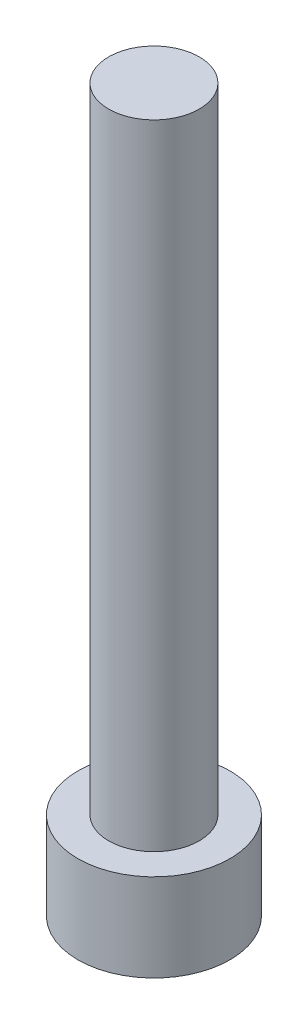
ISO-10303-21;
HEADER;
FILE_DESCRIPTION(('STEP AP214'),'2;1');
FILE_NAME('part.step','',(''),(''),'','','');
FILE_SCHEMA(('AUTOMOTIVE_DESIGN { 1 0 10303 214 1 1 1 1 }'));
ENDSEC;
DATA;
#1=APPLICATION_CONTEXT('core data for automotive mechanical design processes');
#2=APPLICATION_PROTOCOL_DEFINITION('international standard','automotive_design',2000,#1);
#3=PRODUCT_CONTEXT('',#1,'mechanical');
#4=PRODUCT('Part','Part','',(#3));
#5=PRODUCT_RELATED_PRODUCT_CATEGORY('part','',(#4));
#6=PRODUCT_DEFINITION_FORMATION('','',#4);
#7=PRODUCT_DEFINITION_CONTEXT('part definition',#1,'design');
#8=PRODUCT_DEFINITION('design','',#6,#7);
#9=PRODUCT_DEFINITION_SHAPE('','',#8);
#10=(LENGTH_UNIT() NAMED_UNIT(*) SI_UNIT(.MILLI.,.METRE.));
#11=(NAMED_UNIT(*) PLANE_ANGLE_UNIT() SI_UNIT($,.RADIAN.));
#12=(NAMED_UNIT(*) SI_UNIT($,.STERADIAN.) SOLID_ANGLE_UNIT());
#13=UNCERTAINTY_MEASURE_WITH_UNIT(LENGTH_MEASURE(1.E-05),#10,'distance_accuracy_value','');
#14=(GEOMETRIC_REPRESENTATION_CONTEXT(3) GLOBAL_UNCERTAINTY_ASSIGNED_CONTEXT((#13)) GLOBAL_UNIT_ASSIGNED_CONTEXT((#10,
#11,#12)) REPRESENTATION_CONTEXT('',''));
#15=CARTESIAN_POINT('',(0.,0.,0.));
#16=DIRECTION('',(0.,0.,1.));
#17=DIRECTION('',(1.,0.,0.));
#18=AXIS2_PLACEMENT_3D('',#15,#16,#17);
#19=CARTESIAN_POINT('',(0.,4.84,0.));
#20=DIRECTION('',(0.,-1.,0.));
#21=DIRECTION('',(0.,0.,-1.));
#22=AXIS2_PLACEMENT_3D('',#19,#20,#21);
#23=CYLINDRICAL_SURFACE('',#22,4.2);
#24=CARTESIAN_POINT('',(0.,4.84,0.));
#25=DIRECTION('',(0.,1.,0.));
#26=DIRECTION('',(0.,0.,1.));
#27=AXIS2_PLACEMENT_3D('',#24,#25,#26);
#28=CIRCLE('',#27,4.2);
#29=CARTESIAN_POINT('',(0.,4.84,4.2));
#30=VERTEX_POINT('',#29);
#31=EDGE_CURVE('E43',#30,#30,#28,.T.);
#32=ORIENTED_EDGE('',*,*,#31,.F.);
#33=EDGE_LOOP('',(#32));
#34=FACE_BOUND('',#33,.T.);
#35=CARTESIAN_POINT('',(0.,0.,0.));
#36=DIRECTION('',(0.,1.,0.));
#37=DIRECTION('',(0.,0.,1.));
#38=AXIS2_PLACEMENT_3D('',#35,#36,#37);
#39=CIRCLE('',#38,4.2);
#40=CARTESIAN_POINT('',(0.,0.,4.2));
#41=VERTEX_POINT('',#40);
#42=EDGE_CURVE('E38',#41,#41,#39,.T.);
#43=ORIENTED_EDGE('',*,*,#42,.T.);
#44=EDGE_LOOP('',(#43));
#45=FACE_BOUND('',#44,.T.);
#46=ADVANCED_FACE('F35',(#34,#45),#23,.T.);
#47=CARTESIAN_POINT('',(0.,4.84,0.));
#48=DIRECTION('',(0.,1.,0.));
#49=DIRECTION('',(0.,0.,1.));
#50=AXIS2_PLACEMENT_3D('',#47,#48,#49);
#51=PLANE('',#50);
#52=CARTESIAN_POINT('',(0.,4.84,0.));
#53=DIRECTION('',(0.,1.,0.));
#54=DIRECTION('',(0.,0.,1.));
#55=AXIS2_PLACEMENT_3D('',#52,#53,#54);
#56=CIRCLE('',#55,2.5);
#57=CARTESIAN_POINT('',(0.,4.84,2.5));
#58=VERTEX_POINT('',#57);
#59=EDGE_CURVE('E11',#58,#58,#56,.T.);
#60=ORIENTED_EDGE('',*,*,#59,.F.);
#61=EDGE_LOOP('',(#60));
#62=FACE_BOUND('',#61,.T.);
#63=ORIENTED_EDGE('',*,*,#31,.T.);
#64=EDGE_LOOP('',(#63));
#65=FACE_BOUND('',#64,.T.);
#66=ADVANCED_FACE('F155',(#62,#65),#51,.T.);
#67=CARTESIAN_POINT('',(0.,0.,0.));
#68=DIRECTION('',(0.,1.,0.));
#69=DIRECTION('',(0.,0.,1.));
#70=AXIS2_PLACEMENT_3D('',#67,#68,#69);
#71=PLANE('',#70);
#72=DIRECTION('',(-0.5,0.,0.866025403784439));
#73=VECTOR('',#72,1.);
#74=CARTESIAN_POINT('',(2.3,0.,0.));
#75=LINE('',#74,#73);
#76=CARTESIAN_POINT('',(2.3,0.,0.));
#77=VERTEX_POINT('',#76);
#78=CARTESIAN_POINT('',(1.15,0.,1.99185842870421));
#79=VERTEX_POINT('',#78);
#80=EDGE_CURVE('E125',#77,#79,#75,.T.);
#81=ORIENTED_EDGE('',*,*,#80,.F.);
#82=DIRECTION('',(0.5,0.,0.866025403784439));
#83=VECTOR('',#82,1.);
#84=CARTESIAN_POINT('',(1.15,0.,-1.99185842870421));
#85=LINE('',#84,#83);
#86=CARTESIAN_POINT('',(1.15,0.,-1.99185842870421));
#87=VERTEX_POINT('',#86);
#88=EDGE_CURVE('E51',#87,#77,#85,.T.);
#89=ORIENTED_EDGE('',*,*,#88,.F.);
#90=DIRECTION('',(1.,0.,0.));
#91=VECTOR('',#90,1.);
#92=CARTESIAN_POINT('',(-1.15,0.,-1.99185842870421));
#93=LINE('',#92,#91);
#94=CARTESIAN_POINT('',(-1.15,0.,-1.99185842870421));
#95=VERTEX_POINT('',#94);
#96=EDGE_CURVE('E134',#95,#87,#93,.T.);
#97=ORIENTED_EDGE('',*,*,#96,.F.);
#98=DIRECTION('',(0.5,0.,-0.866025403784439));
#99=VECTOR('',#98,1.);
#100=CARTESIAN_POINT('',(-2.3,0.,0.));
#101=LINE('',#100,#99);
#102=CARTESIAN_POINT('',(-2.3,0.,0.));
#103=VERTEX_POINT('',#102);
#104=EDGE_CURVE('E132',#103,#95,#101,.T.);
#105=ORIENTED_EDGE('',*,*,#104,.F.);
#106=DIRECTION('',(-0.5,0.,-0.866025403784439));
#107=VECTOR('',#106,1.);
#108=CARTESIAN_POINT('',(-1.15,0.,1.99185842870421));
#109=LINE('',#108,#107);
#110=CARTESIAN_POINT('',(-1.15,0.,1.99185842870421));
#111=VERTEX_POINT('',#110);
#112=EDGE_CURVE('E99',#111,#103,#109,.T.);
#113=ORIENTED_EDGE('',*,*,#112,.F.);
#114=DIRECTION('',(-1.,0.,0.));
#115=VECTOR('',#114,1.);
#116=CARTESIAN_POINT('',(1.15,0.,1.99185842870421));
#117=LINE('',#116,#115);
#118=EDGE_CURVE('E128',#79,#111,#117,.T.);
#119=ORIENTED_EDGE('',*,*,#118,.F.);
#120=EDGE_LOOP('',(#81,#89,#97,#105,#113,#119));
#121=FACE_BOUND('',#120,.T.);
#122=ORIENTED_EDGE('',*,*,#42,.F.);
#123=EDGE_LOOP('',(#122));
#124=FACE_BOUND('',#123,.T.);
#125=ADVANCED_FACE('F152',(#121,#124),#71,.F.);
#126=CARTESIAN_POINT('',(0.,39.84,0.));
#127=DIRECTION('',(0.,-1.,0.));
#128=DIRECTION('',(0.,0.,-1.));
#129=AXIS2_PLACEMENT_3D('',#126,#127,#128);
#130=CYLINDRICAL_SURFACE('',#129,2.5);
#131=CARTESIAN_POINT('',(0.,39.84,0.));
#132=DIRECTION('',(0.,1.,0.));
#133=DIRECTION('',(0.,0.,1.));
#134=AXIS2_PLACEMENT_3D('',#131,#132,#133);
#135=CIRCLE('',#134,2.5);
#136=CARTESIAN_POINT('',(0.,39.84,2.5));
#137=VERTEX_POINT('',#136);
#138=EDGE_CURVE('E138',#137,#137,#135,.T.);
#139=ORIENTED_EDGE('',*,*,#138,.F.);
#140=EDGE_LOOP('',(#139));
#141=FACE_BOUND('',#140,.T.);
#142=ORIENTED_EDGE('',*,*,#59,.T.);
#143=EDGE_LOOP('',(#142));
#144=FACE_BOUND('',#143,.T.);
#145=ADVANCED_FACE('F154',(#141,#144),#130,.T.);
#146=CARTESIAN_POINT('',(0.,39.84,0.));
#147=DIRECTION('',(0.,1.,0.));
#148=DIRECTION('',(0.,0.,1.));
#149=AXIS2_PLACEMENT_3D('',#146,#147,#148);
#150=PLANE('',#149);
#151=ORIENTED_EDGE('',*,*,#138,.T.);
#152=EDGE_LOOP('',(#151));
#153=FACE_BOUND('',#152,.T.);
#154=ADVANCED_FACE('F161',(#153),#150,.T.);
#155=CARTESIAN_POINT('',(1.15,3.4,-1.99185842870421));
#156=DIRECTION('',(0.866025403784439,0.,-0.5));
#157=DIRECTION('',(-0.5,0.,-0.866025403784439));
#158=AXIS2_PLACEMENT_3D('',#155,#156,#157);
#159=PLANE('',#158);
#160=ORIENTED_EDGE('',*,*,#88,.T.);
#161=DIRECTION('',(0.,-1.,0.));
#162=VECTOR('',#161,1.);
#163=CARTESIAN_POINT('',(2.3,3.4,0.));
#164=LINE('',#163,#162);
#165=CARTESIAN_POINT('',(2.3,3.4,0.));
#166=VERTEX_POINT('',#165);
#167=EDGE_CURVE('E81',#166,#77,#164,.T.);
#168=ORIENTED_EDGE('',*,*,#167,.F.);
#169=DIRECTION('',(0.5,0.,0.866025403784439));
#170=VECTOR('',#169,1.);
#171=CARTESIAN_POINT('',(1.15,3.4,-1.99185842870421));
#172=LINE('',#171,#170);
#173=CARTESIAN_POINT('',(1.15,3.4,-1.99185842870421));
#174=VERTEX_POINT('',#173);
#175=EDGE_CURVE('E136',#174,#166,#172,.T.);
#176=ORIENTED_EDGE('',*,*,#175,.F.);
#177=DIRECTION('',(0.,-1.,0.));
#178=VECTOR('',#177,1.);
#179=CARTESIAN_POINT('',(1.15,3.4,-1.99185842870421));
#180=LINE('',#179,#178);
#181=EDGE_CURVE('E59',#174,#87,#180,.T.);
#182=ORIENTED_EDGE('',*,*,#181,.T.);
#183=EDGE_LOOP('',(#160,#168,#176,#182));
#184=FACE_BOUND('',#183,.T.);
#185=ADVANCED_FACE('F190',(#184),#159,.F.);
#186=CARTESIAN_POINT('',(-1.15,3.4,-1.99185842870421));
#187=DIRECTION('',(0.,0.,-1.));
#188=DIRECTION('',(-1.,0.,0.));
#189=AXIS2_PLACEMENT_3D('',#186,#187,#188);
#190=PLANE('',#189);
#191=ORIENTED_EDGE('',*,*,#96,.T.);
#192=ORIENTED_EDGE('',*,*,#181,.F.);
#193=DIRECTION('',(1.,0.,0.));
#194=VECTOR('',#193,1.);
#195=CARTESIAN_POINT('',(-1.15,3.4,-1.99185842870421));
#196=LINE('',#195,#194);
#197=CARTESIAN_POINT('',(-1.15,3.4,-1.99185842870421));
#198=VERTEX_POINT('',#197);
#199=EDGE_CURVE('E111',#198,#174,#196,.T.);
#200=ORIENTED_EDGE('',*,*,#199,.F.);
#201=DIRECTION('',(0.,-1.,0.));
#202=VECTOR('',#201,1.);
#203=CARTESIAN_POINT('',(-1.15,3.4,-1.99185842870421));
#204=LINE('',#203,#202);
#205=EDGE_CURVE('E103',#198,#95,#204,.T.);
#206=ORIENTED_EDGE('',*,*,#205,.T.);
#207=EDGE_LOOP('',(#191,#192,#200,#206));
#208=FACE_BOUND('',#207,.T.);
#209=ADVANCED_FACE('F204',(#208),#190,.F.);
#210=CARTESIAN_POINT('',(-2.3,3.4,0.));
#211=DIRECTION('',(-0.866025403784439,0.,-0.5));
#212=DIRECTION('',(-0.5,0.,0.866025403784439));
#213=AXIS2_PLACEMENT_3D('',#210,#211,#212);
#214=PLANE('',#213);
#215=ORIENTED_EDGE('',*,*,#104,.T.);
#216=ORIENTED_EDGE('',*,*,#205,.F.);
#217=DIRECTION('',(0.5,0.,-0.866025403784439));
#218=VECTOR('',#217,1.);
#219=CARTESIAN_POINT('',(-2.3,3.4,0.));
#220=LINE('',#219,#218);
#221=CARTESIAN_POINT('',(-2.3,3.4,0.));
#222=VERTEX_POINT('',#221);
#223=EDGE_CURVE('E107',#222,#198,#220,.T.);
#224=ORIENTED_EDGE('',*,*,#223,.F.);
#225=DIRECTION('',(0.,-1.,0.));
#226=VECTOR('',#225,1.);
#227=CARTESIAN_POINT('',(-2.3,3.4,0.));
#228=LINE('',#227,#226);
#229=EDGE_CURVE('E92',#222,#103,#228,.T.);
#230=ORIENTED_EDGE('',*,*,#229,.T.);
#231=EDGE_LOOP('',(#215,#216,#224,#230));
#232=FACE_BOUND('',#231,.T.);
#233=ADVANCED_FACE('F108',(#232),#214,.F.);
#234=CARTESIAN_POINT('',(-1.15,3.4,1.99185842870421));
#235=DIRECTION('',(-0.866025403784439,0.,0.5));
#236=DIRECTION('',(0.5,0.,0.866025403784439));
#237=AXIS2_PLACEMENT_3D('',#234,#235,#236);
#238=PLANE('',#237);
#239=ORIENTED_EDGE('',*,*,#112,.T.);
#240=ORIENTED_EDGE('',*,*,#229,.F.);
#241=DIRECTION('',(-0.5,0.,-0.866025403784439));
#242=VECTOR('',#241,1.);
#243=CARTESIAN_POINT('',(-1.15,3.4,1.99185842870421));
#244=LINE('',#243,#242);
#245=CARTESIAN_POINT('',(-1.15,3.4,1.99185842870421));
#246=VERTEX_POINT('',#245);
#247=EDGE_CURVE('E96',#246,#222,#244,.T.);
#248=ORIENTED_EDGE('',*,*,#247,.F.);
#249=DIRECTION('',(0.,-1.,0.));
#250=VECTOR('',#249,1.);
#251=CARTESIAN_POINT('',(-1.15,3.4,1.99185842870421));
#252=LINE('',#251,#250);
#253=EDGE_CURVE('E104',#246,#111,#252,.T.);
#254=ORIENTED_EDGE('',*,*,#253,.T.);
#255=EDGE_LOOP('',(#239,#240,#248,#254));
#256=FACE_BOUND('',#255,.T.);
#257=ADVANCED_FACE('F94',(#256),#238,.F.);
#258=CARTESIAN_POINT('',(1.15,3.4,1.99185842870421));
#259=DIRECTION('',(0.,0.,1.));
#260=DIRECTION('',(1.,0.,0.));
#261=AXIS2_PLACEMENT_3D('',#258,#259,#260);
#262=PLANE('',#261);
#263=ORIENTED_EDGE('',*,*,#118,.T.);
#264=ORIENTED_EDGE('',*,*,#253,.F.);
#265=DIRECTION('',(-1.,0.,0.));
#266=VECTOR('',#265,1.);
#267=CARTESIAN_POINT('',(1.15,3.4,1.99185842870421));
#268=LINE('',#267,#266);
#269=CARTESIAN_POINT('',(1.15,3.4,1.99185842870421));
#270=VERTEX_POINT('',#269);
#271=EDGE_CURVE('E117',#270,#246,#268,.T.);
#272=ORIENTED_EDGE('',*,*,#271,.F.);
#273=DIRECTION('',(0.,-1.,0.));
#274=VECTOR('',#273,1.);
#275=CARTESIAN_POINT('',(1.15,3.4,1.99185842870421));
#276=LINE('',#275,#274);
#277=EDGE_CURVE('E141',#270,#79,#276,.T.);
#278=ORIENTED_EDGE('',*,*,#277,.T.);
#279=EDGE_LOOP('',(#263,#264,#272,#278));
#280=FACE_BOUND('',#279,.T.);
#281=ADVANCED_FACE('F229',(#280),#262,.F.);
#282=CARTESIAN_POINT('',(2.3,3.4,0.));
#283=DIRECTION('',(0.866025403784439,0.,0.5));
#284=DIRECTION('',(0.5,0.,-0.866025403784439));
#285=AXIS2_PLACEMENT_3D('',#282,#283,#284);
#286=PLANE('',#285);
#287=ORIENTED_EDGE('',*,*,#80,.T.);
#288=ORIENTED_EDGE('',*,*,#277,.F.);
#289=DIRECTION('',(-0.5,0.,0.866025403784439));
#290=VECTOR('',#289,1.);
#291=CARTESIAN_POINT('',(2.3,3.4,0.));
#292=LINE('',#291,#290);
#293=EDGE_CURVE('E119',#166,#270,#292,.T.);
#294=ORIENTED_EDGE('',*,*,#293,.F.);
#295=ORIENTED_EDGE('',*,*,#167,.T.);
#296=EDGE_LOOP('',(#287,#288,#294,#295));
#297=FACE_BOUND('',#296,.T.);
#298=ADVANCED_FACE('F238',(#297),#286,.F.);
#299=CARTESIAN_POINT('',(0.,3.4,0.));
#300=DIRECTION('',(0.,-1.,0.));
#301=DIRECTION('',(0.,0.,-1.));
#302=AXIS2_PLACEMENT_3D('',#299,#300,#301);
#303=PLANE('',#302);
#304=ORIENTED_EDGE('',*,*,#175,.T.);
#305=ORIENTED_EDGE('',*,*,#293,.T.);
#306=ORIENTED_EDGE('',*,*,#271,.T.);
#307=ORIENTED_EDGE('',*,*,#247,.T.);
#308=ORIENTED_EDGE('',*,*,#223,.T.);
#309=ORIENTED_EDGE('',*,*,#199,.T.);
#310=EDGE_LOOP('',(#304,#305,#306,#307,#308,#309));
#311=FACE_BOUND('',#310,.T.);
#312=ADVANCED_FACE('F114',(#311),#303,.T.);
#313=CLOSED_SHELL('',(#46,#66,#125,#145,#154,#185,#209,#233,#257,#281,#298,#312));
#314=MANIFOLD_SOLID_BREP('B2',#313);
#315=ADVANCED_BREP_SHAPE_REPRESENTATION('',(#18,#314),#14);
#316=SHAPE_DEFINITION_REPRESENTATION(#9,#315);
ENDSEC;
END-ISO-10303-21;
